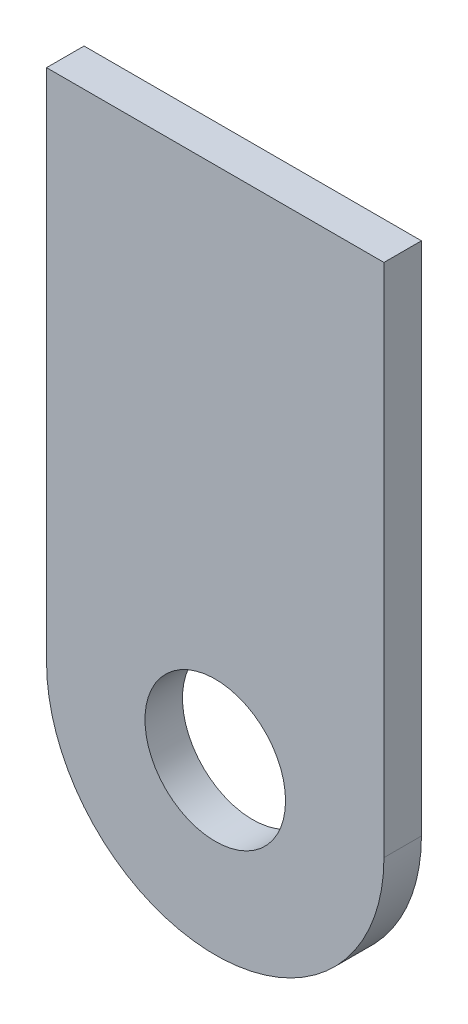
ISO-10303-21;
HEADER;
FILE_DESCRIPTION(('STEP AP214'),'2;1');
FILE_NAME('part.step','',(''),(''),'','','');
FILE_SCHEMA(('AUTOMOTIVE_DESIGN { 1 0 10303 214 1 1 1 1 }'));
ENDSEC;
DATA;
#1=APPLICATION_CONTEXT('core data for automotive mechanical design processes');
#2=APPLICATION_PROTOCOL_DEFINITION('international standard','automotive_design',2000,#1);
#3=PRODUCT_CONTEXT('',#1,'mechanical');
#4=PRODUCT('Part','Part','',(#3));
#5=PRODUCT_RELATED_PRODUCT_CATEGORY('part','',(#4));
#6=PRODUCT_DEFINITION_FORMATION('','',#4);
#7=PRODUCT_DEFINITION_CONTEXT('part definition',#1,'design');
#8=PRODUCT_DEFINITION('design','',#6,#7);
#9=PRODUCT_DEFINITION_SHAPE('','',#8);
#10=(LENGTH_UNIT() NAMED_UNIT(*) SI_UNIT(.MILLI.,.METRE.));
#11=(NAMED_UNIT(*) PLANE_ANGLE_UNIT() SI_UNIT($,.RADIAN.));
#12=(NAMED_UNIT(*) SI_UNIT($,.STERADIAN.) SOLID_ANGLE_UNIT());
#13=UNCERTAINTY_MEASURE_WITH_UNIT(LENGTH_MEASURE(1.E-05),#10,'distance_accuracy_value','');
#14=(GEOMETRIC_REPRESENTATION_CONTEXT(3) GLOBAL_UNCERTAINTY_ASSIGNED_CONTEXT((#13)) GLOBAL_UNIT_ASSIGNED_CONTEXT((#10,
#11,#12)) REPRESENTATION_CONTEXT('',''));
#15=CARTESIAN_POINT('',(0.,0.,0.));
#16=DIRECTION('',(0.,0.,1.));
#17=DIRECTION('',(1.,0.,0.));
#18=AXIS2_PLACEMENT_3D('',#15,#16,#17);
#19=CARTESIAN_POINT('',(-11.43,0.,2.54));
#20=DIRECTION('',(-1.,0.,0.));
#21=DIRECTION('',(0.,0.,1.));
#22=AXIS2_PLACEMENT_3D('',#19,#20,#21);
#23=PLANE('',#22);
#24=DIRECTION('',(0.,1.,0.));
#25=VECTOR('',#24,1.);
#26=CARTESIAN_POINT('',(-11.43,0.,0.));
#27=LINE('',#26,#25);
#28=CARTESIAN_POINT('',(-11.43,0.,0.));
#29=VERTEX_POINT('',#28);
#30=CARTESIAN_POINT('',(-11.43,34.925,0.));
#31=VERTEX_POINT('',#30);
#32=EDGE_CURVE('E103',#29,#31,#27,.T.);
#33=ORIENTED_EDGE('',*,*,#32,.F.);
#34=DIRECTION('',(0.,0.,-1.));
#35=VECTOR('',#34,1.);
#36=CARTESIAN_POINT('',(-11.43,0.,2.54));
#37=LINE('',#36,#35);
#38=CARTESIAN_POINT('',(-11.43,0.,2.54));
#39=VERTEX_POINT('',#38);
#40=EDGE_CURVE('E11',#39,#29,#37,.T.);
#41=ORIENTED_EDGE('',*,*,#40,.F.);
#42=DIRECTION('',(0.,1.,0.));
#43=VECTOR('',#42,1.);
#44=CARTESIAN_POINT('',(-11.43,0.,2.54));
#45=LINE('',#44,#43);
#46=CARTESIAN_POINT('',(-11.43,34.925,2.54));
#47=VERTEX_POINT('',#46);
#48=EDGE_CURVE('E85',#39,#47,#45,.T.);
#49=ORIENTED_EDGE('',*,*,#48,.T.);
#50=DIRECTION('',(0.,0.,-1.));
#51=VECTOR('',#50,1.);
#52=CARTESIAN_POINT('',(-11.43,34.925,2.54));
#53=LINE('',#52,#51);
#54=EDGE_CURVE('E52',#47,#31,#53,.T.);
#55=ORIENTED_EDGE('',*,*,#54,.T.);
#56=EDGE_LOOP('',(#33,#41,#49,#55));
#57=FACE_BOUND('',#56,.T.);
#58=ADVANCED_FACE('F36',(#57),#23,.T.);
#59=CARTESIAN_POINT('',(0.,0.,2.54));
#60=DIRECTION('',(0.,0.,-1.));
#61=DIRECTION('',(-1.,0.,0.));
#62=AXIS2_PLACEMENT_3D('',#59,#60,#61);
#63=CYLINDRICAL_SURFACE('',#62,11.43);
#64=CARTESIAN_POINT('',(0.,0.,0.));
#65=DIRECTION('',(0.,0.,1.));
#66=DIRECTION('',(1.,0.,0.));
#67=AXIS2_PLACEMENT_3D('',#64,#65,#66);
#68=CIRCLE('',#67,11.43);
#69=CARTESIAN_POINT('',(11.43,0.,0.));
#70=VERTEX_POINT('',#69);
#71=EDGE_CURVE('E91',#29,#70,#68,.T.);
#72=ORIENTED_EDGE('',*,*,#71,.T.);
#73=DIRECTION('',(0.,0.,-1.));
#74=VECTOR('',#73,1.);
#75=CARTESIAN_POINT('',(11.43,0.,2.54));
#76=LINE('',#75,#74);
#77=CARTESIAN_POINT('',(11.43,0.,2.54));
#78=VERTEX_POINT('',#77);
#79=EDGE_CURVE('E44',#78,#70,#76,.T.);
#80=ORIENTED_EDGE('',*,*,#79,.F.);
#81=CARTESIAN_POINT('',(0.,0.,2.54));
#82=DIRECTION('',(0.,0.,1.));
#83=DIRECTION('',(1.,0.,0.));
#84=AXIS2_PLACEMENT_3D('',#81,#82,#83);
#85=CIRCLE('',#84,11.43);
#86=EDGE_CURVE('E78',#39,#78,#85,.T.);
#87=ORIENTED_EDGE('',*,*,#86,.F.);
#88=ORIENTED_EDGE('',*,*,#40,.T.);
#89=EDGE_LOOP('',(#72,#80,#87,#88));
#90=FACE_BOUND('',#89,.T.);
#91=ADVANCED_FACE('F89',(#90),#63,.T.);
#92=CARTESIAN_POINT('',(11.43,0.,2.54));
#93=DIRECTION('',(-1.,0.,0.));
#94=DIRECTION('',(0.,0.,1.));
#95=AXIS2_PLACEMENT_3D('',#92,#93,#94);
#96=PLANE('',#95);
#97=DIRECTION('',(0.,1.,0.));
#98=VECTOR('',#97,1.);
#99=CARTESIAN_POINT('',(11.43,0.,0.));
#100=LINE('',#99,#98);
#101=CARTESIAN_POINT('',(11.43,34.925,0.));
#102=VERTEX_POINT('',#101);
#103=EDGE_CURVE('E106',#70,#102,#100,.T.);
#104=ORIENTED_EDGE('',*,*,#103,.T.);
#105=DIRECTION('',(0.,0.,-1.));
#106=VECTOR('',#105,1.);
#107=CARTESIAN_POINT('',(11.43,34.925,2.54));
#108=LINE('',#107,#106);
#109=CARTESIAN_POINT('',(11.43,34.925,2.54));
#110=VERTEX_POINT('',#109);
#111=EDGE_CURVE('E66',#110,#102,#108,.T.);
#112=ORIENTED_EDGE('',*,*,#111,.F.);
#113=DIRECTION('',(0.,1.,0.));
#114=VECTOR('',#113,1.);
#115=CARTESIAN_POINT('',(11.43,0.,2.54));
#116=LINE('',#115,#114);
#117=EDGE_CURVE('E84',#78,#110,#116,.T.);
#118=ORIENTED_EDGE('',*,*,#117,.F.);
#119=ORIENTED_EDGE('',*,*,#79,.T.);
#120=EDGE_LOOP('',(#104,#112,#118,#119));
#121=FACE_BOUND('',#120,.T.);
#122=ADVANCED_FACE('F94',(#121),#96,.F.);
#123=CARTESIAN_POINT('',(0.,34.925,2.54));
#124=DIRECTION('',(0.,1.,0.));
#125=DIRECTION('',(0.,0.,1.));
#126=AXIS2_PLACEMENT_3D('',#123,#124,#125);
#127=PLANE('',#126);
#128=DIRECTION('',(1.,0.,0.));
#129=VECTOR('',#128,1.);
#130=CARTESIAN_POINT('',(0.,34.925,0.));
#131=LINE('',#130,#129);
#132=EDGE_CURVE('E108',#31,#102,#131,.T.);
#133=ORIENTED_EDGE('',*,*,#132,.F.);
#134=ORIENTED_EDGE('',*,*,#54,.F.);
#135=DIRECTION('',(1.,0.,0.));
#136=VECTOR('',#135,1.);
#137=CARTESIAN_POINT('',(0.,34.925,2.54));
#138=LINE('',#137,#136);
#139=EDGE_CURVE('E95',#47,#110,#138,.T.);
#140=ORIENTED_EDGE('',*,*,#139,.T.);
#141=ORIENTED_EDGE('',*,*,#111,.T.);
#142=EDGE_LOOP('',(#133,#134,#140,#141));
#143=FACE_BOUND('',#142,.T.);
#144=ADVANCED_FACE('F117',(#143),#127,.T.);
#145=CARTESIAN_POINT('',(0.,0.,2.54));
#146=DIRECTION('',(0.,0.,-1.));
#147=DIRECTION('',(-1.,0.,0.));
#148=AXIS2_PLACEMENT_3D('',#145,#146,#147);
#149=CYLINDRICAL_SURFACE('',#148,4.7625);
#150=CARTESIAN_POINT('',(0.,0.,2.54));
#151=DIRECTION('',(0.,0.,1.));
#152=DIRECTION('',(1.,0.,0.));
#153=AXIS2_PLACEMENT_3D('',#150,#151,#152);
#154=CIRCLE('',#153,4.7625);
#155=CARTESIAN_POINT('',(4.7625,0.,2.54));
#156=VERTEX_POINT('',#155);
#157=EDGE_CURVE('E97',#156,#156,#154,.T.);
#158=ORIENTED_EDGE('',*,*,#157,.T.);
#159=EDGE_LOOP('',(#158));
#160=FACE_BOUND('',#159,.T.);
#161=CARTESIAN_POINT('',(0.,0.,0.));
#162=DIRECTION('',(0.,0.,1.));
#163=DIRECTION('',(1.,0.,0.));
#164=AXIS2_PLACEMENT_3D('',#161,#162,#163);
#165=CIRCLE('',#164,4.7625);
#166=CARTESIAN_POINT('',(4.7625,0.,0.));
#167=VERTEX_POINT('',#166);
#168=EDGE_CURVE('E111',#167,#167,#165,.T.);
#169=ORIENTED_EDGE('',*,*,#168,.F.);
#170=EDGE_LOOP('',(#169));
#171=FACE_BOUND('',#170,.T.);
#172=ADVANCED_FACE('F119',(#160,#171),#149,.F.);
#173=CARTESIAN_POINT('',(0.,0.,2.54));
#174=DIRECTION('',(0.,0.,1.));
#175=DIRECTION('',(1.,0.,0.));
#176=AXIS2_PLACEMENT_3D('',#173,#174,#175);
#177=PLANE('',#176);
#178=ORIENTED_EDGE('',*,*,#48,.F.);
#179=ORIENTED_EDGE('',*,*,#86,.T.);
#180=ORIENTED_EDGE('',*,*,#117,.T.);
#181=ORIENTED_EDGE('',*,*,#139,.F.);
#182=EDGE_LOOP('',(#178,#179,#180,#181));
#183=FACE_BOUND('',#182,.T.);
#184=ORIENTED_EDGE('',*,*,#157,.F.);
#185=EDGE_LOOP('',(#184));
#186=FACE_BOUND('',#185,.T.);
#187=ADVANCED_FACE('F80',(#183,#186),#177,.T.);
#188=CARTESIAN_POINT('',(0.,0.,0.));
#189=DIRECTION('',(0.,0.,1.));
#190=DIRECTION('',(1.,0.,0.));
#191=AXIS2_PLACEMENT_3D('',#188,#189,#190);
#192=PLANE('',#191);
#193=ORIENTED_EDGE('',*,*,#32,.T.);
#194=ORIENTED_EDGE('',*,*,#132,.T.);
#195=ORIENTED_EDGE('',*,*,#103,.F.);
#196=ORIENTED_EDGE('',*,*,#71,.F.);
#197=EDGE_LOOP('',(#193,#194,#195,#196));
#198=FACE_BOUND('',#197,.T.);
#199=ORIENTED_EDGE('',*,*,#168,.T.);
#200=EDGE_LOOP('',(#199));
#201=FACE_BOUND('',#200,.T.);
#202=ADVANCED_FACE('F158',(#198,#201),#192,.F.);
#203=CLOSED_SHELL('',(#58,#91,#122,#144,#172,#187,#202));
#204=MANIFOLD_SOLID_BREP('B2',#203);
#205=ADVANCED_BREP_SHAPE_REPRESENTATION('',(#18,#204),#14);
#206=SHAPE_DEFINITION_REPRESENTATION(#9,#205);
ENDSEC;
END-ISO-10303-21;
